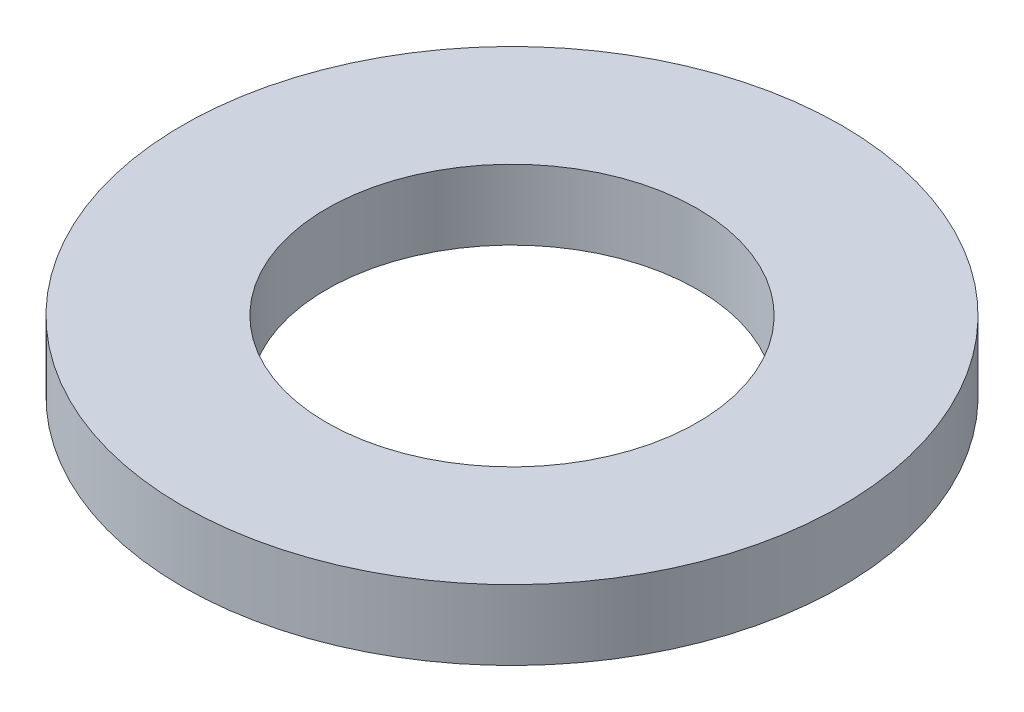
ISO-10303-21;
HEADER;
FILE_DESCRIPTION(('STEP AP214'),'2;1');
FILE_NAME('part.step','',(''),(''),'','','');
FILE_SCHEMA(('AUTOMOTIVE_DESIGN { 1 0 10303 214 1 1 1 1 }'));
ENDSEC;
DATA;
#1=APPLICATION_CONTEXT('core data for automotive mechanical design processes');
#2=APPLICATION_PROTOCOL_DEFINITION('international standard','automotive_design',2000,#1);
#3=PRODUCT_CONTEXT('',#1,'mechanical');
#4=PRODUCT('Part','Part','',(#3));
#5=PRODUCT_RELATED_PRODUCT_CATEGORY('part','',(#4));
#6=PRODUCT_DEFINITION_FORMATION('','',#4);
#7=PRODUCT_DEFINITION_CONTEXT('part definition',#1,'design');
#8=PRODUCT_DEFINITION('design','',#6,#7);
#9=PRODUCT_DEFINITION_SHAPE('','',#8);
#10=(LENGTH_UNIT() NAMED_UNIT(*) SI_UNIT(.MILLI.,.METRE.));
#11=(NAMED_UNIT(*) PLANE_ANGLE_UNIT() SI_UNIT($,.RADIAN.));
#12=(NAMED_UNIT(*) SI_UNIT($,.STERADIAN.) SOLID_ANGLE_UNIT());
#13=UNCERTAINTY_MEASURE_WITH_UNIT(LENGTH_MEASURE(1.E-05),#10,'distance_accuracy_value','');
#14=(GEOMETRIC_REPRESENTATION_CONTEXT(3) GLOBAL_UNCERTAINTY_ASSIGNED_CONTEXT((#13)) GLOBAL_UNIT_ASSIGNED_CONTEXT((#10,
#11,#12)) REPRESENTATION_CONTEXT('',''));
#15=CARTESIAN_POINT('',(0.,0.,0.));
#16=DIRECTION('',(0.,0.,1.));
#17=DIRECTION('',(1.,0.,0.));
#18=AXIS2_PLACEMENT_3D('',#15,#16,#17);
#19=CARTESIAN_POINT('',(0.,17.,0.));
#20=DIRECTION('',(0.,-1.,0.));
#21=DIRECTION('',(0.,0.,-1.));
#22=AXIS2_PLACEMENT_3D('',#19,#20,#21);
#23=CYLINDRICAL_SURFACE('',#22,80.);
#24=CARTESIAN_POINT('',(0.,17.,0.));
#25=DIRECTION('',(0.,1.,0.));
#26=DIRECTION('',(0.,0.,1.));
#27=AXIS2_PLACEMENT_3D('',#24,#25,#26);
#28=CIRCLE('',#27,80.);
#29=CARTESIAN_POINT('',(0.,17.,80.));
#30=VERTEX_POINT('',#29);
#31=EDGE_CURVE('E10',#30,#30,#28,.T.);
#32=ORIENTED_EDGE('',*,*,#31,.F.);
#33=EDGE_LOOP('',(#32));
#34=FACE_BOUND('',#33,.T.);
#35=CARTESIAN_POINT('',(0.,0.,0.));
#36=DIRECTION('',(0.,1.,0.));
#37=DIRECTION('',(0.,0.,1.));
#38=AXIS2_PLACEMENT_3D('',#35,#36,#37);
#39=CIRCLE('',#38,80.);
#40=CARTESIAN_POINT('',(0.,0.,80.));
#41=VERTEX_POINT('',#40);
#42=EDGE_CURVE('E37',#41,#41,#39,.T.);
#43=ORIENTED_EDGE('',*,*,#42,.T.);
#44=EDGE_LOOP('',(#43));
#45=FACE_BOUND('',#44,.T.);
#46=ADVANCED_FACE('F40',(#34,#45),#23,.T.);
#47=CARTESIAN_POINT('',(0.,17.,0.));
#48=DIRECTION('',(0.,1.,0.));
#49=DIRECTION('',(0.,0.,1.));
#50=AXIS2_PLACEMENT_3D('',#47,#48,#49);
#51=PLANE('',#50);
#52=CARTESIAN_POINT('',(0.,17.,0.));
#53=DIRECTION('',(0.,1.,0.));
#54=DIRECTION('',(0.,0.,1.));
#55=AXIS2_PLACEMENT_3D('',#52,#53,#54);
#56=CIRCLE('',#55,45.);
#57=CARTESIAN_POINT('',(0.,17.,45.));
#58=VERTEX_POINT('',#57);
#59=EDGE_CURVE('E50',#58,#58,#56,.T.);
#60=ORIENTED_EDGE('',*,*,#59,.F.);
#61=EDGE_LOOP('',(#60));
#62=FACE_BOUND('',#61,.T.);
#63=ORIENTED_EDGE('',*,*,#31,.T.);
#64=EDGE_LOOP('',(#63));
#65=FACE_BOUND('',#64,.T.);
#66=ADVANCED_FACE('F59',(#62,#65),#51,.T.);
#67=CARTESIAN_POINT('',(0.,0.,0.));
#68=DIRECTION('',(0.,1.,0.));
#69=DIRECTION('',(0.,0.,1.));
#70=AXIS2_PLACEMENT_3D('',#67,#68,#69);
#71=PLANE('',#70);
#72=CARTESIAN_POINT('',(0.,0.,0.));
#73=DIRECTION('',(0.,1.,0.));
#74=DIRECTION('',(0.,0.,1.));
#75=AXIS2_PLACEMENT_3D('',#72,#73,#74);
#76=CIRCLE('',#75,45.);
#77=CARTESIAN_POINT('',(0.,0.,45.));
#78=VERTEX_POINT('',#77);
#79=EDGE_CURVE('E47',#78,#78,#76,.T.);
#80=ORIENTED_EDGE('',*,*,#79,.T.);
#81=EDGE_LOOP('',(#80));
#82=FACE_BOUND('',#81,.T.);
#83=ORIENTED_EDGE('',*,*,#42,.F.);
#84=EDGE_LOOP('',(#83));
#85=FACE_BOUND('',#84,.T.);
#86=ADVANCED_FACE('F58',(#82,#85),#71,.F.);
#87=CARTESIAN_POINT('',(0.,17.,0.));
#88=DIRECTION('',(0.,-1.,0.));
#89=DIRECTION('',(0.,0.,-1.));
#90=AXIS2_PLACEMENT_3D('',#87,#88,#89);
#91=CYLINDRICAL_SURFACE('',#90,45.);
#92=ORIENTED_EDGE('',*,*,#59,.T.);
#93=EDGE_LOOP('',(#92));
#94=FACE_BOUND('',#93,.T.);
#95=ORIENTED_EDGE('',*,*,#79,.F.);
#96=EDGE_LOOP('',(#95));
#97=FACE_BOUND('',#96,.T.);
#98=ADVANCED_FACE('F54',(#94,#97),#91,.F.);
#99=CLOSED_SHELL('',(#46,#66,#86,#98));
#100=MANIFOLD_SOLID_BREP('B2',#99);
#101=ADVANCED_BREP_SHAPE_REPRESENTATION('',(#18,#100),#14);
#102=SHAPE_DEFINITION_REPRESENTATION(#9,#101);
ENDSEC;
END-ISO-10303-21;
